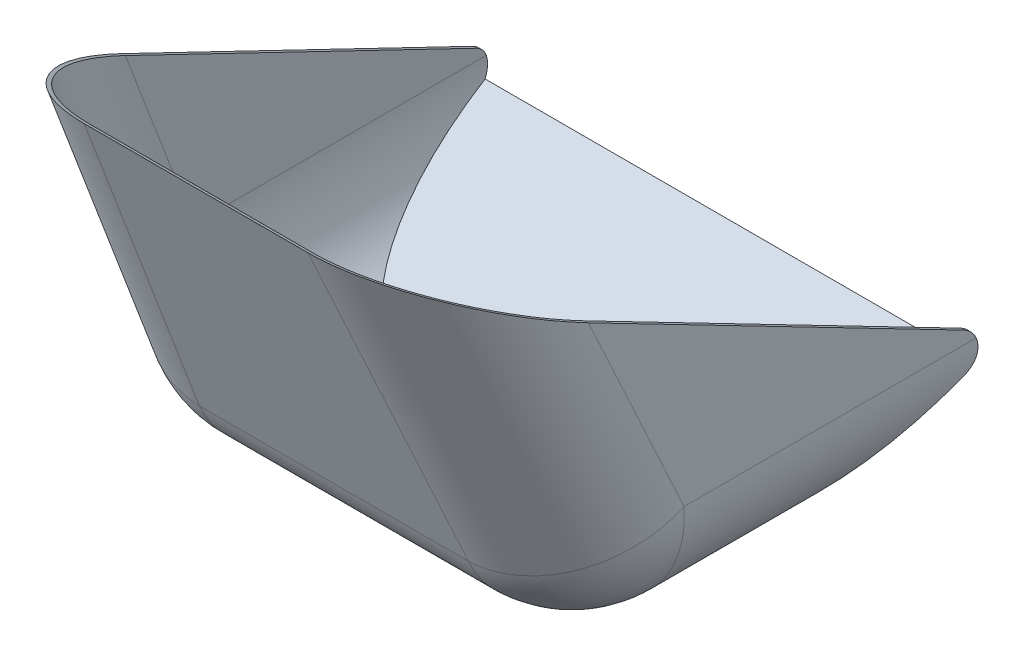
ISO-10303-21;
HEADER;
FILE_DESCRIPTION(('STEP AP214'),'2;1');
FILE_NAME('part.step','',(''),(''),'','','');
FILE_SCHEMA(('AUTOMOTIVE_DESIGN { 1 0 10303 214 1 1 1 1 }'));
ENDSEC;
DATA;
#1=APPLICATION_CONTEXT('core data for automotive mechanical design processes');
#2=APPLICATION_PROTOCOL_DEFINITION('international standard','automotive_design',2000,#1);
#3=PRODUCT_CONTEXT('',#1,'mechanical');
#4=PRODUCT('Part','Part','',(#3));
#5=PRODUCT_RELATED_PRODUCT_CATEGORY('part','',(#4));
#6=PRODUCT_DEFINITION_FORMATION('','',#4);
#7=PRODUCT_DEFINITION_CONTEXT('part definition',#1,'design');
#8=PRODUCT_DEFINITION('design','',#6,#7);
#9=PRODUCT_DEFINITION_SHAPE('','',#8);
#10=(LENGTH_UNIT() NAMED_UNIT(*) SI_UNIT(.MILLI.,.METRE.));
#11=(NAMED_UNIT(*) PLANE_ANGLE_UNIT() SI_UNIT($,.RADIAN.));
#12=(NAMED_UNIT(*) SI_UNIT($,.STERADIAN.) SOLID_ANGLE_UNIT());
#13=UNCERTAINTY_MEASURE_WITH_UNIT(LENGTH_MEASURE(1.E-05),#10,'distance_accuracy_value','');
#14=(GEOMETRIC_REPRESENTATION_CONTEXT(3) GLOBAL_UNCERTAINTY_ASSIGNED_CONTEXT((#13)) GLOBAL_UNIT_ASSIGNED_CONTEXT((#10,
#11,#12)) REPRESENTATION_CONTEXT('',''));
#15=CARTESIAN_POINT('',(0.,0.,0.));
#16=DIRECTION('',(0.,0.,1.));
#17=DIRECTION('',(1.,0.,0.));
#18=AXIS2_PLACEMENT_3D('',#15,#16,#17);
#19=CARTESIAN_POINT('',(-227.,80.0000000000001,-40.));
#20=DIRECTION('',(0.,-0.894427190999916,0.447213595499958));
#21=DIRECTION('',(0.,-0.447213595499958,-0.894427190999916));
#22=AXIS2_PLACEMENT_3D('',#19,#20,#21);
#23=PLANE('',#22);
#24=DIRECTION('',(-0.0312569408351441,0.446995079089161,0.893990158178323));
#25=VECTOR('',#24,1.);
#26=CARTESIAN_POINT('',(207.217843591499,282.898016636033,365.796033272065));
#27=LINE('',#26,#25);
#28=CARTESIAN_POINT('',(218.78726787183,117.447541220729,34.8950824414571));
#29=VERTEX_POINT('',#28);
#30=CARTESIAN_POINT('',(207.478646223475,279.168365237269,358.336730474538));
#31=VERTEX_POINT('',#30);
#32=EDGE_CURVE('E253',#29,#31,#27,.T.);
#33=ORIENTED_EDGE('',*,*,#32,.F.);
#34=DIRECTION('',(1.,0.,0.));
#35=VECTOR('',#34,1.);
#36=CARTESIAN_POINT('',(-227.,117.447541220729,34.895082441457));
#37=LINE('',#36,#35);
#38=CARTESIAN_POINT('',(215.779942177586,117.447541220729,34.8950824414571));
#39=VERTEX_POINT('',#38);
#40=EDGE_CURVE('E434',#29,#39,#37,.F.);
#41=ORIENTED_EDGE('',*,*,#40,.T.);
#42=DIRECTION('',(-0.0312569408351441,0.446995079089161,0.893990158178323));
#43=VECTOR('',#42,1.);
#44=CARTESIAN_POINT('',(204.213456043483,282.855999187418,365.711998374835));
#45=LINE('',#44,#43);
#46=CARTESIAN_POINT('',(204.467377989477,279.224746182512,358.449492365024));
#47=VERTEX_POINT('',#46);
#48=EDGE_CURVE('E238',#39,#47,#45,.T.);
#49=ORIENTED_EDGE('',*,*,#48,.T.);
#50=CARTESIAN_POINT('',(107.103038423518,281.047730078695,362.09546015739));
#51=DIRECTION('',(0.,-0.894427190999916,0.447213595499958));
#52=DIRECTION('',(0.0842667437506437,-0.445622960785833,-0.891245921571668));
#53=AXIS2_PLACEMENT_3D('',#50,#51,#52);
#54=ELLIPSE('',#53,149.866007519839,97.);
#55=CARTESIAN_POINT('',(99.7757839162012,347.931431902361,495.862863804722));
#56=VERTEX_POINT('',#55);
#57=EDGE_CURVE('E188',#56,#47,#54,.F.);
#58=ORIENTED_EDGE('',*,*,#57,.F.);
#59=DIRECTION('',(1.,0.,0.));
#60=VECTOR('',#59,1.);
#61=CARTESIAN_POINT('',(-227.,347.931431902361,495.862863804722));
#62=LINE('',#61,#60);
#63=CARTESIAN_POINT('',(-99.7757839162012,347.931431902361,495.862863804722));
#64=VERTEX_POINT('',#63);
#65=EDGE_CURVE('E195',#64,#56,#62,.T.);
#66=ORIENTED_EDGE('',*,*,#65,.F.);
#67=CARTESIAN_POINT('',(-107.103038423518,281.047730078695,362.09546015739));
#68=DIRECTION('',(0.,-0.894427190999916,0.447213595499958));
#69=DIRECTION('',(0.0842667437506433,0.445622960785833,0.891245921571668));
#70=AXIS2_PLACEMENT_3D('',#67,#68,#69);
#71=ELLIPSE('',#70,149.866007519839,97.);
#72=CARTESIAN_POINT('',(-204.467377989476,279.224746182512,358.449492365024));
#73=VERTEX_POINT('',#72);
#74=EDGE_CURVE('E210',#73,#64,#71,.F.);
#75=ORIENTED_EDGE('',*,*,#74,.F.);
#76=DIRECTION('',(0.0312569408351439,0.446995079089161,0.893990158178323));
#77=VECTOR('',#76,1.);
#78=CARTESIAN_POINT('',(-204.213456043483,282.855999187417,365.711998374835));
#79=LINE('',#78,#77);
#80=CARTESIAN_POINT('',(-215.779942177586,117.447541220729,34.895082441457));
#81=VERTEX_POINT('',#80);
#82=EDGE_CURVE('E184',#81,#73,#79,.T.);
#83=ORIENTED_EDGE('',*,*,#82,.F.);
#84=DIRECTION('',(1.,0.,0.));
#85=VECTOR('',#84,1.);
#86=CARTESIAN_POINT('',(-227.,117.447541220729,34.895082441457));
#87=LINE('',#86,#85);
#88=CARTESIAN_POINT('',(-218.78726787183,117.447541220729,34.8950824414571));
#89=VERTEX_POINT('',#88);
#90=EDGE_CURVE('E390',#81,#89,#87,.F.);
#91=ORIENTED_EDGE('',*,*,#90,.T.);
#92=DIRECTION('',(0.0312569408351439,0.446995079089161,0.893990158178323));
#93=VECTOR('',#92,1.);
#94=CARTESIAN_POINT('',(-207.217843591499,282.898016636033,365.796033272065));
#95=LINE('',#94,#93);
#96=CARTESIAN_POINT('',(-207.478646223475,279.168365237269,358.336730474538));
#97=VERTEX_POINT('',#96);
#98=EDGE_CURVE('E256',#89,#97,#95,.T.);
#99=ORIENTED_EDGE('',*,*,#98,.T.);
#100=CARTESIAN_POINT('',(-107.103038423518,281.047730078695,362.09546015739));
#101=DIRECTION('',(0.,-0.894427190999916,0.447213595499958));
#102=DIRECTION('',(0.0842667437506433,0.445622960785833,0.891245921571668));
#103=AXIS2_PLACEMENT_3D('',#100,#101,#102);
#104=ELLIPSE('',#103,154.501038680246,100.);
#105=CARTESIAN_POINT('',(-99.5491677974182,350.,500.));
#106=VERTEX_POINT('',#105);
#107=EDGE_CURVE('E264',#97,#106,#104,.F.);
#108=ORIENTED_EDGE('',*,*,#107,.T.);
#109=DIRECTION('',(1.,0.,0.));
#110=VECTOR('',#109,1.);
#111=CARTESIAN_POINT('',(-227.,350.,500.));
#112=LINE('',#111,#110);
#113=CARTESIAN_POINT('',(99.5491677974181,350.,500.));
#114=VERTEX_POINT('',#113);
#115=EDGE_CURVE('E250',#106,#114,#112,.T.);
#116=ORIENTED_EDGE('',*,*,#115,.T.);
#117=CARTESIAN_POINT('',(107.103038423518,281.047730078695,362.09546015739));
#118=DIRECTION('',(0.,-0.894427190999916,0.447213595499958));
#119=DIRECTION('',(0.0842667437506437,-0.445622960785833,-0.891245921571668));
#120=AXIS2_PLACEMENT_3D('',#117,#118,#119);
#121=ELLIPSE('',#120,154.501038680246,100.);
#122=EDGE_CURVE('E261',#114,#31,#121,.F.);
#123=ORIENTED_EDGE('',*,*,#122,.T.);
#124=EDGE_LOOP('',(#33,#41,#49,#58,#66,#75,#83,#91,#99,#108,#116,#123));
#125=FACE_BOUND('',#124,.T.);
#126=ADVANCED_FACE('F40',(#125),#23,.F.);
#127=CARTESIAN_POINT('',(-225.895425802168,15.7961469589682,500.));
#128=DIRECTION('',(-0.997564050259824,0.0697564737441288,0.));
#129=DIRECTION('',(-0.0697564737441288,-0.997564050259824,0.));
#130=AXIS2_PLACEMENT_3D('',#127,#128,#129);
#131=PLANE('',#130);
#132=ORIENTED_EDGE('',*,*,#98,.F.);
#133=CARTESIAN_POINT('',(-220.038156711474,99.5589974007303,43.8393543514562));
#134=DIRECTION('',(-0.997564050259824,0.0697564737441288,0.));
#135=DIRECTION('',(0.0697564737441288,0.997564050259824,0.));
#136=AXIS2_PLACEMENT_3D('',#133,#134,#135);
#137=ELLIPSE('',#136,20.0488379616234,20.);
#138=CARTESIAN_POINT('',(-219.519534023514,106.975647374413,25.2653590039852));
#139=VERTEX_POINT('',#138);
#140=EDGE_CURVE('E53',#89,#139,#137,.T.);
#141=ORIENTED_EDGE('',*,*,#140,.T.);
#142=DIRECTION('',(0.,0.,-1.));
#143=VECTOR('',#142,1.);
#144=CARTESIAN_POINT('',(-219.519534023514,106.975647374413,239.836789948915));
#145=LINE('',#144,#143);
#146=CARTESIAN_POINT('',(-219.519534023514,106.975647374413,285.245258207071));
#147=VERTEX_POINT('',#146);
#148=EDGE_CURVE('E284',#139,#147,#145,.F.);
#149=ORIENTED_EDGE('',*,*,#148,.T.);
#150=DIRECTION('',(0.0642350368875341,0.918603824516158,0.38992418958093));
#151=VECTOR('',#150,1.);
#152=CARTESIAN_POINT('',(-219.547111717263,106.58126797997,285.077854086099));
#153=LINE('',#152,#151);
#154=EDGE_CURVE('E258',#147,#97,#153,.T.);
#155=ORIENTED_EDGE('',*,*,#154,.T.);
#156=EDGE_LOOP('',(#132,#141,#149,#155));
#157=FACE_BOUND('',#156,.T.);
#158=ADVANCED_FACE('F346',(#157),#131,.T.);
#159=CARTESIAN_POINT('',(0.,0.,500.));
#160=DIRECTION('',(0.,1.,0.));
#161=DIRECTION('',(-1.,0.,0.));
#162=AXIS2_PLACEMENT_3D('',#159,#160,#161);
#163=PLANE('',#162);
#164=DIRECTION('',(0.,0.,-1.));
#165=VECTOR('',#164,1.);
#166=CARTESIAN_POINT('',(-119.763128997531,0.,0.));
#167=LINE('',#166,#165);
#168=CARTESIAN_POINT('',(-119.763128997531,0.,285.245258207071));
#169=VERTEX_POINT('',#168);
#170=CARTESIAN_POINT('',(-119.763128997531,0.,190.328663106743));
#171=VERTEX_POINT('',#170);
#172=EDGE_CURVE('E279',#169,#171,#167,.T.);
#173=ORIENTED_EDGE('',*,*,#172,.T.);
#174=DIRECTION('',(1.,0.,0.));
#175=VECTOR('',#174,1.);
#176=CARTESIAN_POINT('',(-219.763128997531,0.,190.328663106743));
#177=LINE('',#176,#175);
#178=CARTESIAN_POINT('',(119.763128997531,0.,190.328663106743));
#179=VERTEX_POINT('',#178);
#180=EDGE_CURVE('E236',#171,#179,#177,.T.);
#181=ORIENTED_EDGE('',*,*,#180,.T.);
#182=DIRECTION('',(0.,0.,-1.));
#183=VECTOR('',#182,1.);
#184=CARTESIAN_POINT('',(119.763128997531,0.,500.));
#185=LINE('',#184,#183);
#186=CARTESIAN_POINT('',(119.763128997531,0.,285.245258207071));
#187=VERTEX_POINT('',#186);
#188=EDGE_CURVE('E282',#179,#187,#185,.F.);
#189=ORIENTED_EDGE('',*,*,#188,.T.);
#190=DIRECTION('',(1.,0.,0.));
#191=VECTOR('',#190,1.);
#192=CARTESIAN_POINT('',(-124.023551977648,0.,285.245258207071));
#193=LINE('',#192,#191);
#194=EDGE_CURVE('E277',#187,#169,#193,.F.);
#195=ORIENTED_EDGE('',*,*,#194,.T.);
#196=EDGE_LOOP('',(#173,#181,#189,#195));
#197=FACE_BOUND('',#196,.T.);
#198=ADVANCED_FACE('F352',(#197),#163,.F.);
#199=CARTESIAN_POINT('',(225.895425802168,15.7961469589683,500.));
#200=DIRECTION('',(-0.997564050259824,-0.0697564737441291,0.));
#201=DIRECTION('',(0.0697564737441291,-0.997564050259824,0.));
#202=AXIS2_PLACEMENT_3D('',#199,#200,#201);
#203=PLANE('',#202);
#204=DIRECTION('',(0.,0.,-1.));
#205=VECTOR('',#204,1.);
#206=CARTESIAN_POINT('',(219.519534023514,106.975647374413,500.));
#207=LINE('',#206,#205);
#208=CARTESIAN_POINT('',(219.519534023514,106.975647374413,285.245258207071));
#209=VERTEX_POINT('',#208);
#210=CARTESIAN_POINT('',(219.519534023514,106.975647374413,25.2653590039852));
#211=VERTEX_POINT('',#210);
#212=EDGE_CURVE('E274',#209,#211,#207,.T.);
#213=ORIENTED_EDGE('',*,*,#212,.T.);
#214=CARTESIAN_POINT('',(220.038156711474,99.5589974007303,43.8393543514562));
#215=DIRECTION('',(-0.997564050259824,-0.0697564737441291,0.));
#216=DIRECTION('',(0.0697564737441291,-0.997564050259824,0.));
#217=AXIS2_PLACEMENT_3D('',#214,#215,#216);
#218=ELLIPSE('',#217,20.0488379616234,20.);
#219=EDGE_CURVE('E314',#211,#29,#218,.F.);
#220=ORIENTED_EDGE('',*,*,#219,.T.);
#221=ORIENTED_EDGE('',*,*,#32,.T.);
#222=DIRECTION('',(-0.0642350368875344,0.918603824516158,0.38992418958093));
#223=VECTOR('',#222,1.);
#224=CARTESIAN_POINT('',(224.20485224116,39.9724752373585,256.804099028735));
#225=LINE('',#224,#223);
#226=EDGE_CURVE('E271',#31,#209,#225,.F.);
#227=ORIENTED_EDGE('',*,*,#226,.T.);
#228=EDGE_LOOP('',(#213,#220,#221,#227));
#229=FACE_BOUND('',#228,.T.);
#230=ADVANCED_FACE('F361',(#229),#203,.F.);
#231=CARTESIAN_POINT('',(-227.,-126.400164914987,297.780127555489));
#232=DIRECTION('',(0.,-0.390731128489268,0.920504853452443));
#233=DIRECTION('',(0.,-0.920504853452443,-0.390731128489268));
#234=AXIS2_PLACEMENT_3D('',#231,#232,#233);
#235=PLANE('',#234);
#236=DIRECTION('',(0.0642350368875341,0.918603824516158,0.38992418958093));
#237=VECTOR('',#236,1.);
#238=CARTESIAN_POINT('',(-133.250737813632,-131.954905129063,295.422280224027));
#239=LINE('',#238,#237);
#240=CARTESIAN_POINT('',(-119.763128997531,60.9268871510732,377.295743552316));
#241=VERTEX_POINT('',#240);
#242=EDGE_CURVE('E268',#106,#241,#239,.F.);
#243=ORIENTED_EDGE('',*,*,#242,.T.);
#244=DIRECTION('',(1.,0.,0.));
#245=VECTOR('',#244,1.);
#246=CARTESIAN_POINT('',(124.023551977648,60.9268871510732,377.295743552316));
#247=LINE('',#246,#245);
#248=CARTESIAN_POINT('',(119.763128997531,60.9268871510731,377.295743552316));
#249=VERTEX_POINT('',#248);
#250=EDGE_CURVE('E288',#241,#249,#247,.T.);
#251=ORIENTED_EDGE('',*,*,#250,.T.);
#252=DIRECTION('',(-0.0642350368875344,0.918603824516158,0.38992418958093));
#253=VECTOR('',#252,1.);
#254=CARTESIAN_POINT('',(99.9740630349481,343.923715014019,497.420770047339));
#255=LINE('',#254,#253);
#256=EDGE_CURVE('E266',#249,#114,#255,.T.);
#257=ORIENTED_EDGE('',*,*,#256,.T.);
#258=ORIENTED_EDGE('',*,*,#115,.F.);
#259=EDGE_LOOP('',(#243,#251,#257,#258));
#260=FACE_BOUND('',#259,.T.);
#261=ADVANCED_FACE('F358',(#260),#235,.T.);
#262=CARTESIAN_POINT('',(-119.790706691281,99.6056206055574,285.077854086099));
#263=DIRECTION('',(0.0642350368875341,0.918603824516158,0.38992418958093));
#264=DIRECTION('',(0.,-0.390731128489268,0.920504853452443));
#265=AXIS2_PLACEMENT_3D('',#262,#263,#264);
#266=CYLINDRICAL_SURFACE('',#265,100.);
#267=ORIENTED_EDGE('',*,*,#154,.F.);
#268=CARTESIAN_POINT('',(-119.763128997531,100.,285.245258207071));
#269=DIRECTION('',(0.0642350368875341,0.918603824516158,0.38992418958093));
#270=DIRECTION('',(0.,-0.390731128489268,0.920504853452443));
#271=AXIS2_PLACEMENT_3D('',#268,#269,#270);
#272=CIRCLE('',#271,100.);
#273=EDGE_CURVE('E286',#147,#241,#272,.T.);
#274=ORIENTED_EDGE('',*,*,#273,.T.);
#275=ORIENTED_EDGE('',*,*,#242,.F.);
#276=ORIENTED_EDGE('',*,*,#107,.F.);
#277=EDGE_LOOP('',(#267,#274,#275,#276));
#278=FACE_BOUND('',#277,.T.);
#279=ADVANCED_FACE('F343',(#278),#266,.T.);
#280=CARTESIAN_POINT('',(131.377470270002,-66.0928183291538,214.74303967307));
#281=DIRECTION('',(0.0642350368875344,-0.918603824516158,-0.38992418958093));
#282=DIRECTION('',(0.,0.390731128489268,-0.920504853452443));
#283=AXIS2_PLACEMENT_3D('',#280,#281,#282);
#284=CYLINDRICAL_SURFACE('',#283,100.);
#285=ORIENTED_EDGE('',*,*,#256,.F.);
#286=CARTESIAN_POINT('',(119.763128997531,100.,285.245258207071));
#287=DIRECTION('',(0.0642350368875344,-0.918603824516158,-0.38992418958093));
#288=DIRECTION('',(0.,0.390731128489268,-0.920504853452443));
#289=AXIS2_PLACEMENT_3D('',#286,#287,#288);
#290=CIRCLE('',#289,100.);
#291=EDGE_CURVE('E290',#249,#209,#290,.F.);
#292=ORIENTED_EDGE('',*,*,#291,.T.);
#293=ORIENTED_EDGE('',*,*,#226,.F.);
#294=ORIENTED_EDGE('',*,*,#122,.F.);
#295=EDGE_LOOP('',(#285,#292,#293,#294));
#296=FACE_BOUND('',#295,.T.);
#297=ADVANCED_FACE('F324',(#296),#284,.T.);
#298=CARTESIAN_POINT('',(-119.763128997531,100.,500.));
#299=DIRECTION('',(0.,0.,1.));
#300=DIRECTION('',(1.,0.,0.));
#301=AXIS2_PLACEMENT_3D('',#298,#299,#300);
#302=CYLINDRICAL_SURFACE('',#301,100.);
#303=ORIENTED_EDGE('',*,*,#148,.F.);
#304=CARTESIAN_POINT('',(-219.519534023514,106.975647374413,25.2653590039852));
#305=CARTESIAN_POINT('',(-219.53747379062,106.719113925578,25.1629240926563));
#306=CARTESIAN_POINT('',(-219.554566561188,106.460434204434,25.0657956909469));
#307=CARTESIAN_POINT('',(-219.586945499444,105.939176448286,24.8823063327814));
#308=CARTESIAN_POINT('',(-219.602231691558,105.676598466042,24.7959452307459));
#309=CARTESIAN_POINT('',(-219.645206407091,104.883704573901,24.5532731949447));
#310=CARTESIAN_POINT('',(-219.670018396004,104.34812493317,24.4133320928656));
#311=CARTESIAN_POINT('',(-219.711199119792,103.26733009184,24.1783817145682));
#312=CARTESIAN_POINT('',(-219.72757467892,102.722123049309,24.0833361274231));
#313=CARTESIAN_POINT('',(-219.745457141433,101.899835285021,23.9748892441565));
#314=CARTESIAN_POINT('',(-219.750304529568,101.624984581424,23.944426784294));
#315=CARTESIAN_POINT('',(-219.757739238615,101.074155837209,23.8949119929547));
#316=CARTESIAN_POINT('',(-219.760325979481,100.798177525503,23.8758625902757));
#317=CARTESIAN_POINT('',(-219.764650793542,99.9690608784836,23.8359031325047));
#318=CARTESIAN_POINT('',(-219.762948199293,99.4149809206327,23.8322134756804));
#319=CARTESIAN_POINT('',(-219.750353365487,98.3085296232378,23.8708099466098));
#320=CARTESIAN_POINT('',(-219.739461098675,97.7561582887659,23.9130962107187));
#321=CARTESIAN_POINT('',(-219.716433711231,96.9320109075821,24.010700145835));
#322=CARTESIAN_POINT('',(-219.707642808772,96.6580238820625,24.0489318029563));
#323=CARTESIAN_POINT('',(-219.687891747151,96.1120185079373,24.1366952249974));
#324=CARTESIAN_POINT('',(-219.676932148687,95.8399996692769,24.186224069628));
#325=CARTESIAN_POINT('',(-219.640892247097,95.0274665964762,24.3516488898223));
#326=CARTESIAN_POINT('',(-219.612649269728,94.4904203975393,24.4843897246373));
#327=CARTESIAN_POINT('',(-219.548517964907,93.4305476405657,24.7934519021562));
#328=CARTESIAN_POINT('',(-219.512642576028,92.9076986857583,24.9696995714991));
#329=CARTESIAN_POINT('',(-219.434147659312,91.8787770346711,25.3645642857595));
#330=CARTESIAN_POINT('',(-219.391528087302,91.3727044482995,25.5831816081923));
#331=CARTESIAN_POINT('',(-219.300618710273,90.380412592941,26.0613624675146));
#332=CARTESIAN_POINT('',(-219.252325844269,89.8942042339871,26.3209481347647));
#333=CARTESIAN_POINT('',(-219.17661201043,89.1825877957866,26.7394736722188));
#334=CARTESIAN_POINT('',(-219.150827293226,88.9483233082822,26.883845917746));
#335=CARTESIAN_POINT('',(-219.098324461618,88.4859616412807,27.1821162883171));
#336=CARTESIAN_POINT('',(-219.071606115323,88.2578660192902,27.3360167873691));
#337=CARTESIAN_POINT('',(-218.989439112685,87.5761918786855,27.8167206374678));
#338=CARTESIAN_POINT('',(-218.932799827948,87.1328736307512,28.1580335323058));
#339=CARTESIAN_POINT('',(-218.817923457703,86.2765009480625,28.8764775755014));
#340=CARTESIAN_POINT('',(-218.759686359294,85.8634467577638,29.2536090131241));
#341=CARTESIAN_POINT('',(-218.672354065624,85.2688997726343,29.8439596612293));
#342=CARTESIAN_POINT('',(-218.643258222027,85.0749586302622,30.0447713115139));
#343=CARTESIAN_POINT('',(-218.585265735411,84.6956842256127,30.4542954919467));
#344=CARTESIAN_POINT('',(-218.556369045386,84.5103488683593,30.6630060764993));
#345=CARTESIAN_POINT('',(-218.470280205612,83.9677712423028,31.3004213909028));
#346=CARTESIAN_POINT('',(-218.413659144172,83.623754305674,31.7406114032347));
#347=CARTESIAN_POINT('',(-218.313307216625,83.031321321783,32.5678459292562));
#348=CARTESIAN_POINT('',(-218.269071275617,82.77677118821,32.9504690917051));
#349=CARTESIAN_POINT('',(-218.183594694187,82.2948758114446,33.7319017992327));
#350=CARTESIAN_POINT('',(-218.142349139788,82.0674855202463,34.1306830300045));
#351=CARTESIAN_POINT('',(-218.102962651137,81.854005483824,34.5370287700608));
#352=B_SPLINE_CURVE_WITH_KNOTS('',3,(#304,#305,#306,#307,#308,#309,#310,#311,#312,#313,#314,
#315,#316,#317,#318,#319,#320,#321,#322,#323,#324,#325,#326,#327,#328,#329,#330,#331,#332,#333,
#334,#335,#336,#337,#338,#339,#340,#341,#342,#343,#344,#345,#346,#347,#348,#349,#350,#351),
.UNSPECIFIED.,.F.,.F.,(4,2,2,2,2,2,2,2,2,2,2,2,2,2,2,2,2,2,2,2,2,2,2,4),(0.,0.830312008007383,
1.66061278855995,3.32087945243192,4.97980100456896,5.80931316593237,6.63903810410186,
8.29921227486221,9.95939136937257,10.7895185997245,11.6194314873779,13.2790903448305,
14.9359578292475,16.5928361662787,18.2506126019505,19.0795622951357,19.9087193626594,
21.5936723360068,23.2786389179261,24.1204840002794,24.9621230593681,26.6445402990792,
28.0285579879143,29.4102472581853),.UNSPECIFIED.);
#353=CARTESIAN_POINT('',(-218.102962651137,81.854005483824,34.5370287700608));
#354=VERTEX_POINT('',#353);
#355=EDGE_CURVE('E11',#139,#354,#352,.T.);
#356=ORIENTED_EDGE('',*,*,#355,.T.);
#357=CARTESIAN_POINT('',(-119.763128997531,100.,2.77555756156289E-13));
#358=DIRECTION('',(0.,0.885249595845315,0.465116279069768));
#359=DIRECTION('',(0.,-0.465116279069768,0.885249595845315));
#360=AXIS2_PLACEMENT_3D('',#357,#358,#359);
#361=ELLIPSE('',#360,215.,100.);
#362=EDGE_CURVE('E246',#171,#354,#361,.F.);
#363=ORIENTED_EDGE('',*,*,#362,.F.);
#364=ORIENTED_EDGE('',*,*,#172,.F.);
#365=CARTESIAN_POINT('',(-119.763128997531,100.,285.245258207071));
#366=DIRECTION('',(0.,0.,1.));
#367=DIRECTION('',(1.,0.,0.));
#368=AXIS2_PLACEMENT_3D('',#365,#366,#367);
#369=CIRCLE('',#368,100.);
#370=EDGE_CURVE('E254',#147,#169,#369,.T.);
#371=ORIENTED_EDGE('',*,*,#370,.F.);
#372=EDGE_LOOP('',(#303,#356,#363,#364,#371));
#373=FACE_BOUND('',#372,.T.);
#374=ADVANCED_FACE('F335',(#373),#302,.T.);
#375=CARTESIAN_POINT('',(-119.763128997531,100.,285.245258207071));
#376=DIRECTION('',(0.,1.,0.));
#377=DIRECTION('',(-1.,0.,0.));
#378=AXIS2_PLACEMENT_3D('',#375,#376,#377);
#379=SPHERICAL_SURFACE('',#378,100.);
#380=ORIENTED_EDGE('',*,*,#273,.F.);
#381=ORIENTED_EDGE('',*,*,#370,.T.);
#382=CARTESIAN_POINT('',(-119.763128997531,99.9999999999999,285.245258207071));
#383=DIRECTION('',(1.,0.,0.));
#384=DIRECTION('',(0.,1.,0.));
#385=AXIS2_PLACEMENT_3D('',#382,#383,#384);
#386=CIRCLE('',#385,100.);
#387=EDGE_CURVE('E298',#241,#169,#386,.T.);
#388=ORIENTED_EDGE('',*,*,#387,.F.);
#389=EDGE_LOOP('',(#380,#381,#388));
#390=FACE_BOUND('',#389,.T.);
#391=ADVANCED_FACE('F332',(#390),#379,.T.);
#392=CARTESIAN_POINT('',(-227.,100.,285.245258207071));
#393=DIRECTION('',(-1.,0.,0.));
#394=DIRECTION('',(0.,-1.,0.));
#395=AXIS2_PLACEMENT_3D('',#392,#393,#394);
#396=CYLINDRICAL_SURFACE('',#395,100.);
#397=CARTESIAN_POINT('',(119.763128997531,100.,285.245258207071));
#398=DIRECTION('',(1.,0.,0.));
#399=DIRECTION('',(0.,1.,0.));
#400=AXIS2_PLACEMENT_3D('',#397,#398,#399);
#401=CIRCLE('',#400,100.);
#402=EDGE_CURVE('E295',#249,#187,#401,.T.);
#403=ORIENTED_EDGE('',*,*,#402,.F.);
#404=ORIENTED_EDGE('',*,*,#250,.F.);
#405=ORIENTED_EDGE('',*,*,#387,.T.);
#406=ORIENTED_EDGE('',*,*,#194,.F.);
#407=EDGE_LOOP('',(#403,#404,#405,#406));
#408=FACE_BOUND('',#407,.T.);
#409=ADVANCED_FACE('F328',(#408),#396,.T.);
#410=CARTESIAN_POINT('',(119.763128997531,100.,285.245258207071));
#411=DIRECTION('',(0.,1.,0.));
#412=DIRECTION('',(-1.,0.,0.));
#413=AXIS2_PLACEMENT_3D('',#410,#411,#412);
#414=SPHERICAL_SURFACE('',#413,100.);
#415=ORIENTED_EDGE('',*,*,#291,.F.);
#416=ORIENTED_EDGE('',*,*,#402,.T.);
#417=CARTESIAN_POINT('',(119.763128997531,100.,285.245258207071));
#418=DIRECTION('',(0.,0.,-1.));
#419=DIRECTION('',(-1.,0.,0.));
#420=AXIS2_PLACEMENT_3D('',#417,#418,#419);
#421=CIRCLE('',#420,100.);
#422=EDGE_CURVE('E249',#209,#187,#421,.T.);
#423=ORIENTED_EDGE('',*,*,#422,.F.);
#424=EDGE_LOOP('',(#415,#416,#423));
#425=FACE_BOUND('',#424,.T.);
#426=ADVANCED_FACE('F322',(#425),#414,.T.);
#427=CARTESIAN_POINT('',(119.763128997531,100.,500.));
#428=DIRECTION('',(0.,0.,-1.));
#429=DIRECTION('',(-1.,0.,0.));
#430=AXIS2_PLACEMENT_3D('',#427,#428,#429);
#431=CYLINDRICAL_SURFACE('',#430,100.);
#432=CARTESIAN_POINT('',(119.763128997531,100.,2.22044604925031E-13));
#433=DIRECTION('',(0.,0.885249595845315,0.465116279069768));
#434=DIRECTION('',(0.,0.465116279069768,-0.885249595845315));
#435=AXIS2_PLACEMENT_3D('',#432,#433,#434);
#436=ELLIPSE('',#435,215.,100.);
#437=CARTESIAN_POINT('',(218.102962651137,81.854005483824,34.5370287700608));
#438=VERTEX_POINT('',#437);
#439=EDGE_CURVE('E292',#438,#179,#436,.F.);
#440=ORIENTED_EDGE('',*,*,#439,.F.);
#441=CARTESIAN_POINT('',(218.102962651137,81.854005483824,34.5370287700608));
#442=CARTESIAN_POINT('',(218.127219640029,81.9854677081005,34.286818197818));
#443=CARTESIAN_POINT('',(218.152176687474,82.1221915101214,34.0394771927636));
#444=CARTESIAN_POINT('',(218.203311198499,82.4059286334471,33.55091223873));
#445=CARTESIAN_POINT('',(218.229488610761,82.5529415222171,33.3096880331915));
#446=CARTESIAN_POINT('',(218.309569166527,83.0089903412984,32.5958675922459));
#447=CARTESIAN_POINT('',(218.365035246719,83.3331147674648,32.1329745061592));
#448=CARTESIAN_POINT('',(218.478526144,84.0190402690601,31.2366530936529));
#449=CARTESIAN_POINT('',(218.536549876693,84.3808254639584,30.8032124743304));
#450=CARTESIAN_POINT('',(218.624289924447,84.9498270914649,30.1773009534546));
#451=CARTESIAN_POINT('',(218.653655440836,85.1438915481074,29.9726961139034));
#452=CARTESIAN_POINT('',(218.712430787616,85.5405432246825,29.571822284304));
#453=CARTESIAN_POINT('',(218.741840627502,85.7431326350049,29.3755554629688));
#454=CARTESIAN_POINT('',(218.829829344032,86.3631713194438,28.799797311562));
#455=CARTESIAN_POINT('',(218.888167763487,86.7928932675289,28.4333458520252));
#456=CARTESIAN_POINT('',(219.002572008954,87.6819746226989,27.7379621958512));
#457=CARTESIAN_POINT('',(219.058637851271,88.1413338170749,27.4090297299839));
#458=CARTESIAN_POINT('',(219.139867980249,88.8500952857374,26.945593679102));
#459=CARTESIAN_POINT('',(219.166467569719,89.0896459894747,26.7961035023333));
#460=CARTESIAN_POINT('',(219.218528902973,89.5748875032466,26.5073827213903));
#461=CARTESIAN_POINT('',(219.243990934479,89.8205767358697,26.3681495170756));
#462=CARTESIAN_POINT('',(219.318419169462,90.5663587964089,25.9661535216812));
#463=CARTESIAN_POINT('',(219.365433340386,91.0752163451815,25.719061422438));
#464=CARTESIAN_POINT('',(219.452827371943,92.1111685116271,25.2692697138185));
#465=CARTESIAN_POINT('',(219.493223224943,92.6382153276643,25.0664626877145));
#466=CARTESIAN_POINT('',(219.566430918593,93.7080737681354,24.7059993879315));
#467=CARTESIAN_POINT('',(219.599242699607,94.2508855164959,24.5483434692862));
#468=CARTESIAN_POINT('',(219.656399955841,95.3484941554366,24.2794197360368));
#469=CARTESIAN_POINT('',(219.680742833116,95.9032946683874,24.1681661538678));
#470=CARTESIAN_POINT('',(219.720298802437,97.0206284050195,23.9930340821658));
#471=CARTESIAN_POINT('',(219.735512291252,97.58316129156,23.9291535337428));
#472=CARTESIAN_POINT('',(219.756243176012,98.7020149890532,23.8499908286049));
#473=CARTESIAN_POINT('',(219.761923855766,99.2582747716057,23.8338865597195));
#474=CARTESIAN_POINT('',(219.763989215564,100.370282940118,23.8480807069896));
#475=CARTESIAN_POINT('',(219.760372930089,100.926031266966,23.8783839425797));
#476=CARTESIAN_POINT('',(219.744005283329,102.032251083381,23.9850991309091));
#477=CARTESIAN_POINT('',(219.731265026929,102.58272816408,24.0614550146581));
#478=CARTESIAN_POINT('',(219.697072655707,103.674950054173,24.259599784297));
#479=CARTESIAN_POINT('',(219.675624494938,104.216698711008,24.3813680474689));
#480=CARTESIAN_POINT('',(219.632167953358,105.130135629214,24.6269719481163));
#481=CARTESIAN_POINT('',(219.612181233066,105.504960518376,24.7396574872811));
#482=CARTESIAN_POINT('',(219.568536123667,106.24650136249,24.9865083527854));
#483=CARTESIAN_POINT('',(219.544884395457,106.613230675859,25.1206347256115));
#484=CARTESIAN_POINT('',(219.519534023514,106.975647374413,25.2653590039852));
#485=B_SPLINE_CURVE_WITH_KNOTS('',3,(#441,#442,#443,#444,#445,#446,#447,#448,#449,#450,#451,
#452,#453,#454,#455,#456,#457,#458,#459,#460,#461,#462,#463,#464,#465,#466,#467,#468,#469,#470,
#471,#472,#473,#474,#475,#476,#477,#478,#479,#480,#481,#482,#483,#484),.UNSPECIFIED.,.F.,.F.,(4,
2,2,2,2,2,2,2,2,2,2,2,2,2,2,2,2,2,2,2,2,4),(0.,0.850920036760293,1.70180432382962,
3.40306756739069,5.10361631794641,5.95397228721393,6.80454809605244,8.50568978973428,
10.2068192755403,11.0574506490779,11.9078656403598,13.6085148662197,15.3049920547256,
17.0014825826672,18.6984930729371,20.3954298047345,22.0629920155877,23.7307274150667,
25.3964364378672,27.0613899463862,28.2364601462867,29.4094192577817),.UNSPECIFIED.);
#486=EDGE_CURVE('E307',#438,#211,#485,.T.);
#487=ORIENTED_EDGE('',*,*,#486,.T.);
#488=ORIENTED_EDGE('',*,*,#212,.F.);
#489=ORIENTED_EDGE('',*,*,#422,.T.);
#490=ORIENTED_EDGE('',*,*,#188,.F.);
#491=EDGE_LOOP('',(#440,#487,#488,#489,#490));
#492=FACE_BOUND('',#491,.T.);
#493=ADVANCED_FACE('F316',(#492),#431,.T.);
#494=CARTESIAN_POINT('',(-219.763128997531,78.3666846944295,41.1743998067589));
#495=DIRECTION('',(0.,0.885249595845315,0.465116279069768));
#496=DIRECTION('',(0.,-0.465116279069768,0.885249595845315));
#497=AXIS2_PLACEMENT_3D('',#494,#495,#496);
#498=PLANE('',#497);
#499=ORIENTED_EDGE('',*,*,#362,.T.);
#500=DIRECTION('',(1.,0.,0.));
#501=VECTOR('',#500,1.);
#502=CARTESIAN_POINT('',(-219.763128997531,81.854005483824,34.5370287700608));
#503=LINE('',#502,#501);
#504=EDGE_CURVE('E304',#354,#438,#503,.T.);
#505=ORIENTED_EDGE('',*,*,#504,.T.);
#506=ORIENTED_EDGE('',*,*,#439,.T.);
#507=ORIENTED_EDGE('',*,*,#180,.F.);
#508=EDGE_LOOP('',(#499,#505,#506,#507));
#509=FACE_BOUND('',#508,.T.);
#510=ADVANCED_FACE('F321',(#509),#498,.F.);
#511=CARTESIAN_POINT('',(-222.902733651389,15.5868775377358,500.));
#512=DIRECTION('',(-0.997564050259824,0.0697564737441288,0.));
#513=DIRECTION('',(-0.0697564737441288,-0.997564050259824,0.));
#514=AXIS2_PLACEMENT_3D('',#511,#512,#513);
#515=PLANE('',#514);
#516=DIRECTION('',(0.,0.,1.));
#517=VECTOR('',#516,1.);
#518=CARTESIAN_POINT('',(-216.526841872734,106.76637795318,500.));
#519=LINE('',#518,#517);
#520=CARTESIAN_POINT('',(-216.526841872734,106.76637795318,25.1831579124132));
#521=VERTEX_POINT('',#520);
#522=CARTESIAN_POINT('',(-216.526841872734,106.76637795318,285.245258207071));
#523=VERTEX_POINT('',#522);
#524=EDGE_CURVE('E168',#521,#523,#519,.T.);
#525=ORIENTED_EDGE('',*,*,#524,.F.);
#526=CARTESIAN_POINT('',(-217.030831017231,99.5589974007303,43.8393543514562));
#527=DIRECTION('',(-0.997564050259824,0.0697564737441288,0.));
#528=DIRECTION('',(0.0697564737441288,0.997564050259824,0.));
#529=AXIS2_PLACEMENT_3D('',#526,#527,#528);
#530=ELLIPSE('',#529,20.0488379616234,20.);
#531=EDGE_CURVE('E394',#521,#81,#530,.F.);
#532=ORIENTED_EDGE('',*,*,#531,.T.);
#533=ORIENTED_EDGE('',*,*,#82,.T.);
#534=DIRECTION('',(0.0642350368875341,0.918603824516158,0.38992418958093));
#535=VECTOR('',#534,1.);
#536=CARTESIAN_POINT('',(-216.554419566484,106.371998558738,285.077854086098));
#537=LINE('',#536,#535);
#538=EDGE_CURVE('E181',#523,#73,#537,.T.);
#539=ORIENTED_EDGE('',*,*,#538,.F.);
#540=EDGE_LOOP('',(#525,#532,#533,#539));
#541=FACE_BOUND('',#540,.T.);
#542=ADVANCED_FACE('F182',(#541),#515,.F.);
#543=CARTESIAN_POINT('',(0.,3.,500.));
#544=DIRECTION('',(0.,1.,0.));
#545=DIRECTION('',(-1.,0.,0.));
#546=AXIS2_PLACEMENT_3D('',#543,#544,#545);
#547=PLANE('',#546);
#548=DIRECTION('',(0.,0.,1.));
#549=VECTOR('',#548,1.);
#550=CARTESIAN_POINT('',(-119.763128997531,2.99999999999999,500.));
#551=LINE('',#550,#549);
#552=CARTESIAN_POINT('',(-119.763128997531,2.99999999999999,285.245258207071));
#553=VERTEX_POINT('',#552);
#554=CARTESIAN_POINT('',(-119.763128997531,2.99999999999999,191.06880321354));
#555=VERTEX_POINT('',#554);
#556=EDGE_CURVE('E226',#553,#555,#551,.F.);
#557=ORIENTED_EDGE('',*,*,#556,.F.);
#558=DIRECTION('',(-1.,0.,0.));
#559=VECTOR('',#558,1.);
#560=CARTESIAN_POINT('',(0.,3.,285.245258207071));
#561=LINE('',#560,#559);
#562=CARTESIAN_POINT('',(119.763128997531,3.00000000000001,285.245258207071));
#563=VERTEX_POINT('',#562);
#564=EDGE_CURVE('E218',#563,#553,#561,.T.);
#565=ORIENTED_EDGE('',*,*,#564,.F.);
#566=DIRECTION('',(0.,0.,1.));
#567=VECTOR('',#566,1.);
#568=CARTESIAN_POINT('',(119.763128997531,3.00000000000001,500.));
#569=LINE('',#568,#567);
#570=CARTESIAN_POINT('',(119.763128997531,3.00000000000001,191.06880321354));
#571=VERTEX_POINT('',#570);
#572=EDGE_CURVE('E178',#571,#563,#569,.T.);
#573=ORIENTED_EDGE('',*,*,#572,.F.);
#574=DIRECTION('',(1.,0.,0.));
#575=VECTOR('',#574,1.);
#576=CARTESIAN_POINT('',(0.,3.,191.06880321354));
#577=LINE('',#576,#575);
#578=EDGE_CURVE('E228',#555,#571,#577,.T.);
#579=ORIENTED_EDGE('',*,*,#578,.F.);
#580=EDGE_LOOP('',(#557,#565,#573,#579));
#581=FACE_BOUND('',#580,.T.);
#582=ADVANCED_FACE('F460',(#581),#547,.T.);
#583=CARTESIAN_POINT('',(222.902733651389,15.5868775377359,500.));
#584=DIRECTION('',(-0.997564050259824,-0.0697564737441291,0.));
#585=DIRECTION('',(0.0697564737441291,-0.997564050259824,0.));
#586=AXIS2_PLACEMENT_3D('',#583,#584,#585);
#587=PLANE('',#586);
#588=ORIENTED_EDGE('',*,*,#48,.F.);
#589=CARTESIAN_POINT('',(217.030831017231,99.5589974007303,43.8393543514562));
#590=DIRECTION('',(-0.997564050259824,-0.0697564737441291,0.));
#591=DIRECTION('',(0.0697564737441291,-0.997564050259824,0.));
#592=AXIS2_PLACEMENT_3D('',#589,#590,#591);
#593=ELLIPSE('',#592,20.0488379616234,20.);
#594=CARTESIAN_POINT('',(216.526841872734,106.766377953181,25.1831579124132));
#595=VERTEX_POINT('',#594);
#596=EDGE_CURVE('E432',#39,#595,#593,.T.);
#597=ORIENTED_EDGE('',*,*,#596,.T.);
#598=DIRECTION('',(0.,0.,1.));
#599=VECTOR('',#598,1.);
#600=CARTESIAN_POINT('',(216.526841872734,106.766377953181,500.));
#601=LINE('',#600,#599);
#602=CARTESIAN_POINT('',(216.526841872734,106.766377953181,285.245258207071));
#603=VERTEX_POINT('',#602);
#604=EDGE_CURVE('E215',#603,#595,#601,.F.);
#605=ORIENTED_EDGE('',*,*,#604,.F.);
#606=DIRECTION('',(0.0642350368875344,-0.918603824516158,-0.38992418958093));
#607=VECTOR('',#606,1.);
#608=CARTESIAN_POINT('',(228.141183145205,-59.3264403759732,214.74303967307));
#609=LINE('',#608,#607);
#610=EDGE_CURVE('E205',#47,#603,#609,.T.);
#611=ORIENTED_EDGE('',*,*,#610,.F.);
#612=EDGE_LOOP('',(#588,#597,#605,#611));
#613=FACE_BOUND('',#612,.T.);
#614=ADVANCED_FACE('F443',(#613),#587,.T.);
#615=CARTESIAN_POINT('',(-227.,-125.227971529519,295.018612995132));
#616=DIRECTION('',(0.,-0.390731128489268,0.920504853452443));
#617=DIRECTION('',(0.,-0.920504853452443,-0.390731128489268));
#618=AXIS2_PLACEMENT_3D('',#615,#616,#617);
#619=PLANE('',#618);
#620=DIRECTION('',(0.0642350368875341,0.918603824516158,0.38992418958093));
#621=VECTOR('',#620,1.);
#622=CARTESIAN_POINT('',(-119.790706691281,61.7047011420985,374.366824870986));
#623=LINE('',#622,#621);
#624=CARTESIAN_POINT('',(-119.763128997531,62.099080536541,374.534228991958));
#625=VERTEX_POINT('',#624);
#626=EDGE_CURVE('E199',#64,#625,#623,.F.);
#627=ORIENTED_EDGE('',*,*,#626,.F.);
#628=ORIENTED_EDGE('',*,*,#65,.T.);
#629=DIRECTION('',(0.0642350368875344,-0.918603824516158,-0.38992418958093));
#630=VECTOR('',#629,1.);
#631=CARTESIAN_POINT('',(131.377470270002,-103.993737792613,304.032010457957));
#632=LINE('',#631,#630);
#633=CARTESIAN_POINT('',(119.763128997531,62.0990805365409,374.534228991958));
#634=VERTEX_POINT('',#633);
#635=EDGE_CURVE('E206',#634,#56,#632,.F.);
#636=ORIENTED_EDGE('',*,*,#635,.F.);
#637=DIRECTION('',(1.,0.,0.));
#638=VECTOR('',#637,1.);
#639=CARTESIAN_POINT('',(-227.,62.0990805365411,374.534228991958));
#640=LINE('',#639,#638);
#641=EDGE_CURVE('E200',#625,#634,#640,.T.);
#642=ORIENTED_EDGE('',*,*,#641,.F.);
#643=EDGE_LOOP('',(#627,#628,#636,#642));
#644=FACE_BOUND('',#643,.T.);
#645=ADVANCED_FACE('F456',(#644),#619,.F.);
#646=CARTESIAN_POINT('',(-119.790706691281,99.6056206055574,285.077854086099));
#647=DIRECTION('',(0.0642350368875341,0.918603824516158,0.38992418958093));
#648=DIRECTION('',(0.,-0.390731128489268,0.920504853452443));
#649=AXIS2_PLACEMENT_3D('',#646,#647,#648);
#650=CYLINDRICAL_SURFACE('',#649,97.);
#651=ORIENTED_EDGE('',*,*,#538,.T.);
#652=ORIENTED_EDGE('',*,*,#74,.T.);
#653=ORIENTED_EDGE('',*,*,#626,.T.);
#654=CARTESIAN_POINT('',(-119.763128997531,100.,285.245258207071));
#655=DIRECTION('',(0.0642350368875341,0.918603824516158,0.38992418958093));
#656=DIRECTION('',(0.,-0.390731128489268,0.920504853452443));
#657=AXIS2_PLACEMENT_3D('',#654,#655,#656);
#658=CIRCLE('',#657,97.);
#659=EDGE_CURVE('E177',#523,#625,#658,.T.);
#660=ORIENTED_EDGE('',*,*,#659,.F.);
#661=EDGE_LOOP('',(#651,#652,#653,#660));
#662=FACE_BOUND('',#661,.T.);
#663=ADVANCED_FACE('F197',(#662),#650,.F.);
#664=CARTESIAN_POINT('',(131.377470270002,-66.0928183291538,214.74303967307));
#665=DIRECTION('',(0.0642350368875344,-0.918603824516158,-0.38992418958093));
#666=DIRECTION('',(0.,0.390731128489268,-0.920504853452443));
#667=AXIS2_PLACEMENT_3D('',#664,#665,#666);
#668=CYLINDRICAL_SURFACE('',#667,97.);
#669=ORIENTED_EDGE('',*,*,#635,.T.);
#670=ORIENTED_EDGE('',*,*,#57,.T.);
#671=ORIENTED_EDGE('',*,*,#610,.T.);
#672=CARTESIAN_POINT('',(119.763128997531,99.9999999999999,285.245258207071));
#673=DIRECTION('',(0.0642350368875344,-0.918603824516158,-0.38992418958093));
#674=DIRECTION('',(0.,0.390731128489268,-0.920504853452443));
#675=AXIS2_PLACEMENT_3D('',#672,#673,#674);
#676=CIRCLE('',#675,97.);
#677=EDGE_CURVE('E202',#634,#603,#676,.F.);
#678=ORIENTED_EDGE('',*,*,#677,.F.);
#679=EDGE_LOOP('',(#669,#670,#671,#678));
#680=FACE_BOUND('',#679,.T.);
#681=ADVANCED_FACE('F409',(#680),#668,.F.);
#682=CARTESIAN_POINT('',(-119.763128997531,100.,500.));
#683=DIRECTION('',(0.,0.,1.));
#684=DIRECTION('',(1.,0.,0.));
#685=AXIS2_PLACEMENT_3D('',#682,#683,#684);
#686=CYLINDRICAL_SURFACE('',#685,97.);
#687=CARTESIAN_POINT('',(-119.763128997531,100.,6.45000000000023));
#688=DIRECTION('',(0.,0.885249595845315,0.465116279069768));
#689=DIRECTION('',(0.,-0.465116279069768,0.885249595845315));
#690=AXIS2_PLACEMENT_3D('',#687,#688,#689);
#691=ELLIPSE('',#690,208.55,97.);
#692=CARTESIAN_POINT('',(-216.183319495631,89.4100583424542,26.6056943805911));
#693=VERTEX_POINT('',#692);
#694=EDGE_CURVE('E225',#555,#693,#691,.F.);
#695=ORIENTED_EDGE('',*,*,#694,.T.);
#696=CARTESIAN_POINT('',(-216.183319495631,89.4100583424542,26.6056943805911));
#697=CARTESIAN_POINT('',(-216.209538957366,89.6487756542507,26.4651131569228));
#698=CARTESIAN_POINT('',(-216.235182462965,89.8904358951348,26.3294799580941));
#699=CARTESIAN_POINT('',(-216.285158385241,90.3792832230613,26.0683202564135));
#700=CARTESIAN_POINT('',(-216.309490828016,90.6264701999491,25.942793552356));
#701=CARTESIAN_POINT('',(-216.38027770187,91.3757268877687,25.5817149078124));
#702=CARTESIAN_POINT('',(-216.424529146846,91.8855597392441,25.3616247536009));
#703=CARTESIAN_POINT('',(-216.50594339622,92.9220146741962,24.9645489831201));
#704=CARTESIAN_POINT('',(-216.543109640113,93.4486284657473,24.7875424404066));
#705=CARTESIAN_POINT('',(-216.592828074405,94.248404276439,24.5553008261391));
#706=CARTESIAN_POINT('',(-216.608395951961,94.5166435517393,24.4834306805078));
#707=CARTESIAN_POINT('',(-216.637431175429,95.0560588504642,24.3508782584936));
#708=CARTESIAN_POINT('',(-216.65089797371,95.3272356198936,24.290198898156));
#709=CARTESIAN_POINT('',(-216.688030512651,96.1449798006744,24.1250474289233));
#710=CARTESIAN_POINT('',(-216.708395514468,96.6952362960041,24.0376143392122));
#711=CARTESIAN_POINT('',(-216.739787271059,97.8013933218781,23.9089539250073));
#712=CARTESIAN_POINT('',(-216.750814002889,98.3572938662865,23.8677267140431));
#713=CARTESIAN_POINT('',(-216.760163772078,99.1920498096578,23.8407828273279));
#714=CARTESIAN_POINT('',(-216.762082319426,99.4703950565816,23.837614739918));
#715=CARTESIAN_POINT('',(-216.763524339828,100.026894425397,23.8428923091274));
#716=CARTESIAN_POINT('',(-216.763048512202,100.305048579365,23.8513345742068));
#717=CARTESIAN_POINT('',(-216.758035974958,101.13855857333,23.8940714625464));
#718=CARTESIAN_POINT('',(-216.74991607715,101.69312935117,23.9457707938211));
#719=CARTESIAN_POINT('',(-216.728208035917,102.631263248138,24.0728726795283));
#720=CARTESIAN_POINT('',(-216.716971133422,103.016528882817,24.1366172640118));
#721=CARTESIAN_POINT('',(-216.690108179705,103.782524363487,24.2865015034827));
#722=CARTESIAN_POINT('',(-216.674482507098,104.163254597791,24.3726392265914));
#723=CARTESIAN_POINT('',(-216.639079990829,104.91862921849,24.5669301497838));
#724=CARTESIAN_POINT('',(-216.619305388366,105.293276773428,24.6750714628623));
#725=CARTESIAN_POINT('',(-216.575894913365,106.035482469782,24.9129923019115));
#726=CARTESIAN_POINT('',(-216.552258362438,106.403039352947,25.0427756295964));
#727=CARTESIAN_POINT('',(-216.526841872734,106.76637795318,25.1831579124131));
#728=B_SPLINE_CURVE_WITH_KNOTS('',3,(#696,#697,#698,#699,#700,#701,#702,#703,#704,#705,#706,
#707,#708,#709,#710,#711,#712,#713,#714,#715,#716,#717,#718,#719,#720,#721,#722,#723,#724,#725,
#726,#727),.UNSPECIFIED.,.F.,.F.,(4,2,2,2,2,2,2,2,2,2,2,2,2,2,2,4),(0.,0.834702985258144,
1.66938934868092,3.33852715944996,5.00685261642194,5.84104477067558,6.67545398883672,
8.34590942219802,10.0163689599203,10.8512538907253,11.6858949922294,13.3546762849935,
14.5260596802975,15.6973420526824,16.8679933349484,18.0388504750755),.UNSPECIFIED.);
#729=EDGE_CURVE('E67',#693,#521,#728,.T.);
#730=ORIENTED_EDGE('',*,*,#729,.T.);
#731=ORIENTED_EDGE('',*,*,#524,.T.);
#732=CARTESIAN_POINT('',(-119.763128997531,100.,285.245258207071));
#733=DIRECTION('',(0.,0.,-1.));
#734=DIRECTION('',(-1.,0.,0.));
#735=AXIS2_PLACEMENT_3D('',#732,#733,#734);
#736=CIRCLE('',#735,97.);
#737=EDGE_CURVE('E173',#523,#553,#736,.F.);
#738=ORIENTED_EDGE('',*,*,#737,.T.);
#739=ORIENTED_EDGE('',*,*,#556,.T.);
#740=EDGE_LOOP('',(#695,#730,#731,#738,#739));
#741=FACE_BOUND('',#740,.T.);
#742=ADVANCED_FACE('F170',(#741),#686,.F.);
#743=CARTESIAN_POINT('',(-119.763128997531,100.,285.245258207071));
#744=DIRECTION('',(0.,1.,0.));
#745=DIRECTION('',(-1.,0.,0.));
#746=AXIS2_PLACEMENT_3D('',#743,#744,#745);
#747=SPHERICAL_SURFACE('',#746,97.);
#748=ORIENTED_EDGE('',*,*,#659,.T.);
#749=CARTESIAN_POINT('',(-119.763128997531,100.,285.245258207071));
#750=DIRECTION('',(-1.,0.,0.));
#751=DIRECTION('',(0.,-1.,0.));
#752=AXIS2_PLACEMENT_3D('',#749,#750,#751);
#753=CIRCLE('',#752,97.);
#754=EDGE_CURVE('E194',#625,#553,#753,.F.);
#755=ORIENTED_EDGE('',*,*,#754,.T.);
#756=ORIENTED_EDGE('',*,*,#737,.F.);
#757=EDGE_LOOP('',(#748,#755,#756));
#758=FACE_BOUND('',#757,.T.);
#759=ADVANCED_FACE('F191',(#758),#747,.F.);
#760=CARTESIAN_POINT('',(-227.,100.,285.245258207071));
#761=DIRECTION('',(-1.,0.,0.));
#762=DIRECTION('',(0.,-1.,0.));
#763=AXIS2_PLACEMENT_3D('',#760,#761,#762);
#764=CYLINDRICAL_SURFACE('',#763,97.);
#765=CARTESIAN_POINT('',(119.763128997531,100.,285.245258207071));
#766=DIRECTION('',(-1.,0.,0.));
#767=DIRECTION('',(0.,0.,1.));
#768=AXIS2_PLACEMENT_3D('',#765,#766,#767);
#769=CIRCLE('',#768,97.);
#770=EDGE_CURVE('E219',#634,#563,#769,.F.);
#771=ORIENTED_EDGE('',*,*,#770,.T.);
#772=ORIENTED_EDGE('',*,*,#564,.T.);
#773=ORIENTED_EDGE('',*,*,#754,.F.);
#774=ORIENTED_EDGE('',*,*,#641,.T.);
#775=EDGE_LOOP('',(#771,#772,#773,#774));
#776=FACE_BOUND('',#775,.T.);
#777=ADVANCED_FACE('F413',(#776),#764,.F.);
#778=CARTESIAN_POINT('',(119.763128997531,100.,285.245258207071));
#779=DIRECTION('',(0.,1.,0.));
#780=DIRECTION('',(-1.,0.,0.));
#781=AXIS2_PLACEMENT_3D('',#778,#779,#780);
#782=SPHERICAL_SURFACE('',#781,97.);
#783=ORIENTED_EDGE('',*,*,#677,.T.);
#784=CARTESIAN_POINT('',(119.763128997531,100.,285.245258207071));
#785=DIRECTION('',(0.,0.,-1.));
#786=DIRECTION('',(-1.,0.,0.));
#787=AXIS2_PLACEMENT_3D('',#784,#785,#786);
#788=CIRCLE('',#787,97.);
#789=EDGE_CURVE('E222',#603,#563,#788,.T.);
#790=ORIENTED_EDGE('',*,*,#789,.T.);
#791=ORIENTED_EDGE('',*,*,#770,.F.);
#792=EDGE_LOOP('',(#783,#790,#791));
#793=FACE_BOUND('',#792,.T.);
#794=ADVANCED_FACE('F416',(#793),#782,.F.);
#795=CARTESIAN_POINT('',(119.763128997531,100.,500.));
#796=DIRECTION('',(0.,0.,-1.));
#797=DIRECTION('',(-1.,0.,0.));
#798=AXIS2_PLACEMENT_3D('',#795,#796,#797);
#799=CYLINDRICAL_SURFACE('',#798,97.);
#800=ORIENTED_EDGE('',*,*,#604,.T.);
#801=CARTESIAN_POINT('',(216.526841872734,106.766377953181,25.1831579124132));
#802=CARTESIAN_POINT('',(216.544841737346,106.508985852392,25.0837201792416));
#803=CARTESIAN_POINT('',(216.561952564354,106.249508849338,24.9896002262806));
#804=CARTESIAN_POINT('',(216.594283732989,105.72678033637,24.8121462762682));
#805=CARTESIAN_POINT('',(216.609504099045,105.463528875278,24.7288121398403));
#806=CARTESIAN_POINT('',(216.652156184478,104.668795838568,24.4952398308204));
#807=CARTESIAN_POINT('',(216.676585781094,104.132237999581,24.3613940516265));
#808=CARTESIAN_POINT('',(216.716669942332,103.050184453083,24.1386851821935));
#809=CARTESIAN_POINT('',(216.732334584494,102.504699755376,24.0497704437676));
#810=CARTESIAN_POINT('',(216.74892628708,101.682390263224,23.9504757992978));
#811=CARTESIAN_POINT('',(216.753305999753,101.407600143684,23.9230569161861));
#812=CARTESIAN_POINT('',(216.75973370989,100.857023451019,23.8796097659496));
#813=CARTESIAN_POINT('',(216.761781113928,100.581236642197,23.8635843981519));
#814=CARTESIAN_POINT('',(216.764385569673,99.7527365054682,23.8326556086249));
#815=CARTESIAN_POINT('',(216.761396881,99.1992764340133,23.834946929149));
#816=CARTESIAN_POINT('',(216.745985883706,98.0945762852797,23.8853771009026));
#817=CARTESIAN_POINT('',(216.733563443991,97.5433362389579,23.9335165892505));
#818=CARTESIAN_POINT('',(216.708089664314,96.7212975050715,24.0397624923199));
#819=CARTESIAN_POINT('',(216.698458949492,96.4480998751098,24.0808480559305));
#820=CARTESIAN_POINT('',(216.676984513284,95.903809284481,24.1742625731621));
#821=CARTESIAN_POINT('',(216.665141441493,95.6327157302871,24.2265882271328));
#822=CARTESIAN_POINT('',(216.626395217899,94.8232105865658,24.4003023899849));
#823=CARTESIAN_POINT('',(216.596270347605,94.2884243916573,24.5384475318779));
#824=CARTESIAN_POINT('',(216.537729205561,93.3801524286236,24.8135809264286));
#825=CARTESIAN_POINT('',(216.511184150698,93.0033190721442,24.9401236834312));
#826=CARTESIAN_POINT('',(216.45440331507,92.2580984337585,25.2153220262167));
#827=CARTESIAN_POINT('',(216.424167825461,91.889710488277,25.3639758677606));
#828=CARTESIAN_POINT('',(216.360438222344,91.1629915521501,25.6826926430229));
#829=CARTESIAN_POINT('',(216.326946891003,90.8046523063505,25.8527373338426));
#830=CARTESIAN_POINT('',(216.257137650361,90.0988660977104,26.2137143553046));
#831=CARTESIAN_POINT('',(216.220819303228,89.7514208338076,26.4046499232799));
#832=CARTESIAN_POINT('',(216.183319495631,89.4100583424542,26.6056943805911));
#833=B_SPLINE_CURVE_WITH_KNOTS('',3,(#801,#802,#803,#804,#805,#806,#807,#808,#809,#810,#811,
#812,#813,#814,#815,#816,#817,#818,#819,#820,#821,#822,#823,#824,#825,#826,#827,#828,#829,#830,
#831,#832),.UNSPECIFIED.,.F.,.F.,(4,2,2,2,2,2,2,2,2,2,2,2,2,2,2,4),(0.,0.82943596051833,
1.65886120183279,3.31739809607395,4.97402414210655,5.80237635204514,6.63093927879269,
8.28924894669269,9.94758165923838,10.7766762171478,11.6055277171669,13.2627777822859,
14.4573297228269,15.6517874807303,16.8452333811554,18.0388644853162),.UNSPECIFIED.);
#834=CARTESIAN_POINT('',(216.183319495631,89.4100583424542,26.6056943805911));
#835=VERTEX_POINT('',#834);
#836=EDGE_CURVE('E426',#595,#835,#833,.T.);
#837=ORIENTED_EDGE('',*,*,#836,.T.);
#838=CARTESIAN_POINT('',(119.763128997531,100.,6.45000000000018));
#839=DIRECTION('',(0.,0.885249595845315,0.465116279069768));
#840=DIRECTION('',(0.,0.465116279069768,-0.885249595845315));
#841=AXIS2_PLACEMENT_3D('',#838,#839,#840);
#842=ELLIPSE('',#841,208.55,97.);
#843=EDGE_CURVE('E212',#835,#571,#842,.F.);
#844=ORIENTED_EDGE('',*,*,#843,.T.);
#845=ORIENTED_EDGE('',*,*,#572,.T.);
#846=ORIENTED_EDGE('',*,*,#789,.F.);
#847=EDGE_LOOP('',(#800,#837,#844,#845,#846));
#848=FACE_BOUND('',#847,.T.);
#849=ADVANCED_FACE('F420',(#848),#799,.F.);
#850=CARTESIAN_POINT('',(-219.763128997531,81.0224334819654,42.5697486439683));
#851=DIRECTION('',(0.,0.885249595845315,0.465116279069768));
#852=DIRECTION('',(0.,-0.465116279069768,0.885249595845315));
#853=AXIS2_PLACEMENT_3D('',#850,#851,#852);
#854=PLANE('',#853);
#855=ORIENTED_EDGE('',*,*,#843,.F.);
#856=DIRECTION('',(1.,0.,0.));
#857=VECTOR('',#856,1.);
#858=CARTESIAN_POINT('',(216.183319495631,89.4100583424542,26.6056943805911));
#859=LINE('',#858,#857);
#860=EDGE_CURVE('E403',#835,#693,#859,.F.);
#861=ORIENTED_EDGE('',*,*,#860,.T.);
#862=ORIENTED_EDGE('',*,*,#694,.F.);
#863=ORIENTED_EDGE('',*,*,#578,.T.);
#864=EDGE_LOOP('',(#855,#861,#862,#863));
#865=FACE_BOUND('',#864,.T.);
#866=ADVANCED_FACE('F424',(#865),#854,.T.);
#867=CARTESIAN_POINT('',(-219.763128997531,99.5589974007303,43.8393543514562));
#868=DIRECTION('',(1.,0.,0.));
#869=DIRECTION('',(0.,0.,-1.));
#870=AXIS2_PLACEMENT_3D('',#867,#868,#869);
#871=CYLINDRICAL_SURFACE('',#870,20.);
#872=ORIENTED_EDGE('',*,*,#596,.F.);
#873=ORIENTED_EDGE('',*,*,#40,.F.);
#874=ORIENTED_EDGE('',*,*,#219,.F.);
#875=ORIENTED_EDGE('',*,*,#486,.F.);
#876=ORIENTED_EDGE('',*,*,#504,.F.);
#877=ORIENTED_EDGE('',*,*,#355,.F.);
#878=ORIENTED_EDGE('',*,*,#140,.F.);
#879=ORIENTED_EDGE('',*,*,#90,.F.);
#880=ORIENTED_EDGE('',*,*,#531,.F.);
#881=ORIENTED_EDGE('',*,*,#729,.F.);
#882=ORIENTED_EDGE('',*,*,#860,.F.);
#883=ORIENTED_EDGE('',*,*,#836,.F.);
#884=EDGE_LOOP('',(#872,#873,#874,#875,#876,#877,#878,#879,#880,#881,#882,#883));
#885=FACE_BOUND('',#884,.T.);
#886=ADVANCED_FACE('F42',(#885),#871,.T.);
#887=CLOSED_SHELL('',(#126,#158,#198,#230,#261,#279,#297,#374,#391,#409,#426,#493,#510,#542,
#582,#614,#645,#663,#681,#742,#759,#777,#794,#849,#866,#886));
#888=MANIFOLD_SOLID_BREP('B2',#887);
#889=ADVANCED_BREP_SHAPE_REPRESENTATION('',(#18,#888),#14);
#890=SHAPE_DEFINITION_REPRESENTATION(#9,#889);
ENDSEC;
END-ISO-10303-21;
